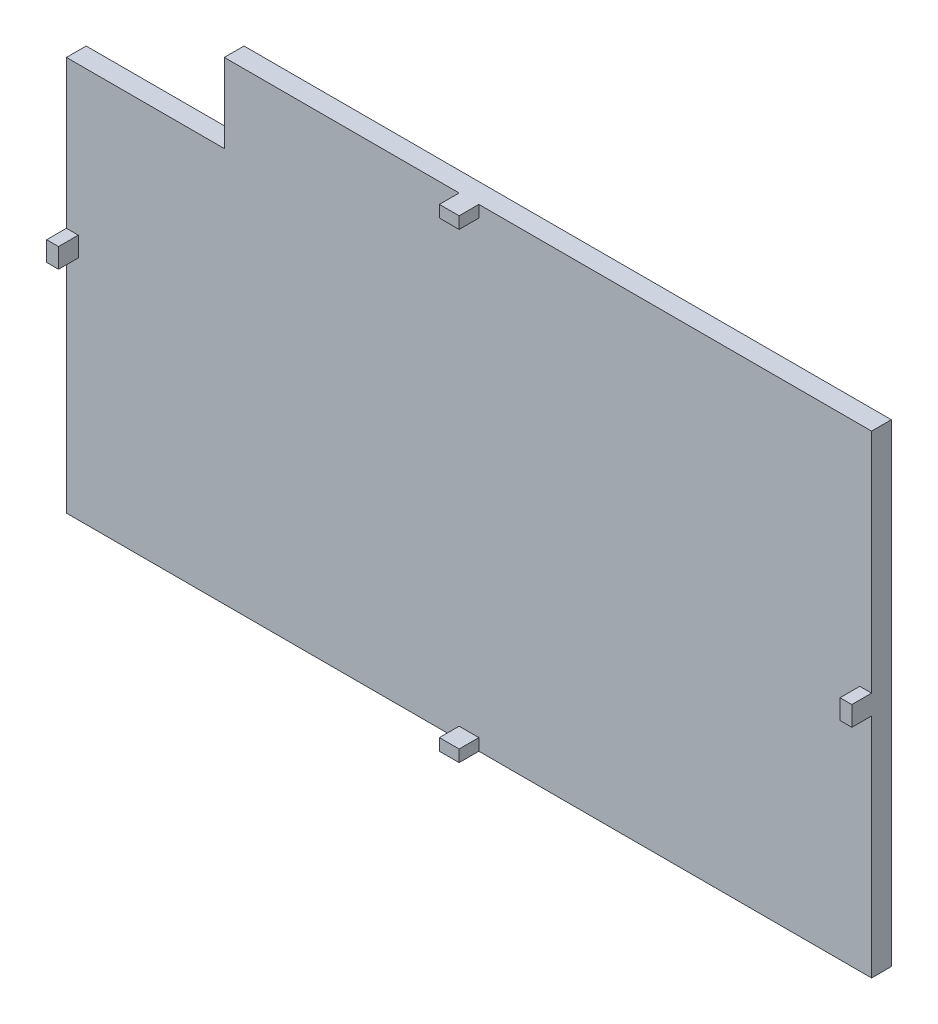
ISO-10303-21;
HEADER;
FILE_DESCRIPTION(('STEP AP214'),'2;1');
FILE_NAME('part.step','',(''),(''),'','','');
FILE_SCHEMA(('AUTOMOTIVE_DESIGN { 1 0 10303 214 1 1 1 1 }'));
ENDSEC;
DATA;
#1=APPLICATION_CONTEXT('core data for automotive mechanical design processes');
#2=APPLICATION_PROTOCOL_DEFINITION('international standard','automotive_design',2000,#1);
#3=PRODUCT_CONTEXT('',#1,'mechanical');
#4=PRODUCT('Part','Part','',(#3));
#5=PRODUCT_RELATED_PRODUCT_CATEGORY('part','',(#4));
#6=PRODUCT_DEFINITION_FORMATION('','',#4);
#7=PRODUCT_DEFINITION_CONTEXT('part definition',#1,'design');
#8=PRODUCT_DEFINITION('design','',#6,#7);
#9=PRODUCT_DEFINITION_SHAPE('','',#8);
#10=(LENGTH_UNIT() NAMED_UNIT(*) SI_UNIT(.MILLI.,.METRE.));
#11=(NAMED_UNIT(*) PLANE_ANGLE_UNIT() SI_UNIT($,.RADIAN.));
#12=(NAMED_UNIT(*) SI_UNIT($,.STERADIAN.) SOLID_ANGLE_UNIT());
#13=UNCERTAINTY_MEASURE_WITH_UNIT(LENGTH_MEASURE(1.E-05),#10,'distance_accuracy_value','');
#14=(GEOMETRIC_REPRESENTATION_CONTEXT(3) GLOBAL_UNCERTAINTY_ASSIGNED_CONTEXT((#13)) GLOBAL_UNIT_ASSIGNED_CONTEXT((#10,
#11,#12)) REPRESENTATION_CONTEXT('',''));
#15=CARTESIAN_POINT('',(0.,0.,0.));
#16=DIRECTION('',(0.,0.,1.));
#17=DIRECTION('',(1.,0.,0.));
#18=AXIS2_PLACEMENT_3D('',#15,#16,#17);
#19=CARTESIAN_POINT('',(0.,0.,5.));
#20=DIRECTION('',(0.,0.,1.));
#21=DIRECTION('',(1.,0.,0.));
#22=AXIS2_PLACEMENT_3D('',#19,#20,#21);
#23=PLANE('',#22);
#24=DIRECTION('',(1.,0.,0.));
#25=VECTOR('',#24,1.);
#26=CARTESIAN_POINT('',(0.,10.8689509306261,5.));
#27=LINE('',#26,#25);
#28=CARTESIAN_POINT('',(-51.4207056882735,10.8689509306261,5.));
#29=VERTEX_POINT('',#28);
#30=CARTESIAN_POINT('',(-11.4207056882735,10.8689509306261,5.));
#31=VERTEX_POINT('',#30);
#32=EDGE_CURVE('E190',#29,#31,#27,.T.);
#33=ORIENTED_EDGE('',*,*,#32,.F.);
#34=DIRECTION('',(0.,-1.,0.));
#35=VECTOR('',#34,1.);
#36=CARTESIAN_POINT('',(-51.4207056882735,30.8689509306261,5.));
#37=LINE('',#36,#35);
#38=CARTESIAN_POINT('',(-51.4207056882735,-26.6310490693739,5.));
#39=VERTEX_POINT('',#38);
#40=EDGE_CURVE('E370',#29,#39,#37,.T.);
#41=ORIENTED_EDGE('',*,*,#40,.T.);
#42=DIRECTION('',(1.,0.,0.));
#43=VECTOR('',#42,1.);
#44=CARTESIAN_POINT('',(-51.4207056882735,-26.6310490693739,5.));
#45=LINE('',#44,#43);
#46=CARTESIAN_POINT('',(-48.4207056882735,-26.6310490693739,5.));
#47=VERTEX_POINT('',#46);
#48=EDGE_CURVE('E286',#39,#47,#45,.T.);
#49=ORIENTED_EDGE('',*,*,#48,.T.);
#50=DIRECTION('',(0.,-1.,0.));
#51=VECTOR('',#50,1.);
#52=CARTESIAN_POINT('',(-48.4207056882735,-26.6310490693739,5.));
#53=LINE('',#52,#51);
#54=CARTESIAN_POINT('',(-48.4207056882735,-31.6310490693739,5.));
#55=VERTEX_POINT('',#54);
#56=EDGE_CURVE('E283',#47,#55,#53,.T.);
#57=ORIENTED_EDGE('',*,*,#56,.T.);
#58=DIRECTION('',(1.,0.,0.));
#59=VECTOR('',#58,1.);
#60=CARTESIAN_POINT('',(-51.4207056882735,-31.6310490693739,5.));
#61=LINE('',#60,#59);
#62=CARTESIAN_POINT('',(-51.4207056882735,-31.6310490693739,5.));
#63=VERTEX_POINT('',#62);
#64=EDGE_CURVE('E280',#63,#55,#61,.T.);
#65=ORIENTED_EDGE('',*,*,#64,.F.);
#66=CARTESIAN_POINT('',(-51.4207056882735,-89.1310490693739,5.));
#67=VERTEX_POINT('',#66);
#68=EDGE_CURVE('E346',#63,#67,#37,.T.);
#69=ORIENTED_EDGE('',*,*,#68,.T.);
#70=DIRECTION('',(1.,0.,0.));
#71=VECTOR('',#70,1.);
#72=CARTESIAN_POINT('',(-51.4207056882735,-89.1310490693739,5.));
#73=LINE('',#72,#71);
#74=CARTESIAN_POINT('',(48.0792943117265,-89.1310490693739,5.));
#75=VERTEX_POINT('',#74);
#76=EDGE_CURVE('E368',#67,#75,#73,.T.);
#77=ORIENTED_EDGE('',*,*,#76,.T.);
#78=DIRECTION('',(0.,1.,0.));
#79=VECTOR('',#78,1.);
#80=CARTESIAN_POINT('',(48.0792943117265,-89.1310490693739,5.));
#81=LINE('',#80,#79);
#82=CARTESIAN_POINT('',(48.0792943117265,-86.1310490693739,5.));
#83=VERTEX_POINT('',#82);
#84=EDGE_CURVE('E249',#75,#83,#81,.T.);
#85=ORIENTED_EDGE('',*,*,#84,.T.);
#86=DIRECTION('',(-1.,0.,0.));
#87=VECTOR('',#86,1.);
#88=CARTESIAN_POINT('',(53.0792943117265,-86.1310490693739,5.));
#89=LINE('',#88,#87);
#90=CARTESIAN_POINT('',(53.0792943117265,-86.1310490693739,5.));
#91=VERTEX_POINT('',#90);
#92=EDGE_CURVE('E251',#91,#83,#89,.T.);
#93=ORIENTED_EDGE('',*,*,#92,.F.);
#94=DIRECTION('',(0.,1.,0.));
#95=VECTOR('',#94,1.);
#96=CARTESIAN_POINT('',(53.0792943117265,-89.1310490693739,5.));
#97=LINE('',#96,#95);
#98=CARTESIAN_POINT('',(53.0792943117265,-89.1310490693739,5.));
#99=VERTEX_POINT('',#98);
#100=EDGE_CURVE('E255',#99,#91,#97,.T.);
#101=ORIENTED_EDGE('',*,*,#100,.F.);
#102=CARTESIAN_POINT('',(152.579294311727,-89.1310490693739,5.));
#103=VERTEX_POINT('',#102);
#104=EDGE_CURVE('E369',#99,#103,#73,.T.);
#105=ORIENTED_EDGE('',*,*,#104,.T.);
#106=DIRECTION('',(0.,-1.,0.));
#107=VECTOR('',#106,1.);
#108=CARTESIAN_POINT('',(152.579294311726,30.8689509306261,5.));
#109=LINE('',#108,#107);
#110=CARTESIAN_POINT('',(152.579294311727,-31.6310490693739,5.));
#111=VERTEX_POINT('',#110);
#112=EDGE_CURVE('E355',#111,#103,#109,.T.);
#113=ORIENTED_EDGE('',*,*,#112,.F.);
#114=DIRECTION('',(-1.,0.,0.));
#115=VECTOR('',#114,1.);
#116=CARTESIAN_POINT('',(152.579294311726,-31.6310490693739,5.));
#117=LINE('',#116,#115);
#118=CARTESIAN_POINT('',(149.579294311726,-31.6310490693739,5.));
#119=VERTEX_POINT('',#118);
#120=EDGE_CURVE('E58',#111,#119,#117,.T.);
#121=ORIENTED_EDGE('',*,*,#120,.T.);
#122=DIRECTION('',(0.,-1.,0.));
#123=VECTOR('',#122,1.);
#124=CARTESIAN_POINT('',(149.579294311726,-26.6310490693739,5.));
#125=LINE('',#124,#123);
#126=CARTESIAN_POINT('',(149.579294311726,-26.6310490693739,5.));
#127=VERTEX_POINT('',#126);
#128=EDGE_CURVE('E220',#127,#119,#125,.T.);
#129=ORIENTED_EDGE('',*,*,#128,.F.);
#130=DIRECTION('',(-1.,0.,0.));
#131=VECTOR('',#130,1.);
#132=CARTESIAN_POINT('',(152.579294311726,-26.6310490693739,5.));
#133=LINE('',#132,#131);
#134=CARTESIAN_POINT('',(152.579294311726,-26.6310490693739,5.));
#135=VERTEX_POINT('',#134);
#136=EDGE_CURVE('E224',#135,#127,#133,.T.);
#137=ORIENTED_EDGE('',*,*,#136,.F.);
#138=CARTESIAN_POINT('',(152.579294311726,30.8689509306261,5.));
#139=VERTEX_POINT('',#138);
#140=EDGE_CURVE('E330',#139,#135,#109,.T.);
#141=ORIENTED_EDGE('',*,*,#140,.F.);
#142=DIRECTION('',(1.,0.,0.));
#143=VECTOR('',#142,1.);
#144=CARTESIAN_POINT('',(-51.4207056882735,30.8689509306261,5.));
#145=LINE('',#144,#143);
#146=CARTESIAN_POINT('',(53.0792943117265,30.8689509306261,5.));
#147=VERTEX_POINT('',#146);
#148=EDGE_CURVE('E329',#147,#139,#145,.T.);
#149=ORIENTED_EDGE('',*,*,#148,.F.);
#150=DIRECTION('',(0.,-1.,0.));
#151=VECTOR('',#150,1.);
#152=CARTESIAN_POINT('',(53.0792943117265,30.8689509306261,5.));
#153=LINE('',#152,#151);
#154=CARTESIAN_POINT('',(53.0792943117265,27.8689509306261,5.));
#155=VERTEX_POINT('',#154);
#156=EDGE_CURVE('E288',#147,#155,#153,.T.);
#157=ORIENTED_EDGE('',*,*,#156,.T.);
#158=DIRECTION('',(-1.,0.,0.));
#159=VECTOR('',#158,1.);
#160=CARTESIAN_POINT('',(53.0792943117265,27.8689509306261,5.));
#161=LINE('',#160,#159);
#162=CARTESIAN_POINT('',(48.0792943117265,27.8689509306261,5.));
#163=VERTEX_POINT('',#162);
#164=EDGE_CURVE('E311',#155,#163,#161,.T.);
#165=ORIENTED_EDGE('',*,*,#164,.T.);
#166=DIRECTION('',(0.,-1.,0.));
#167=VECTOR('',#166,1.);
#168=CARTESIAN_POINT('',(48.0792943117265,30.8689509306261,5.));
#169=LINE('',#168,#167);
#170=CARTESIAN_POINT('',(48.0792943117265,30.8689509306261,5.));
#171=VERTEX_POINT('',#170);
#172=EDGE_CURVE('E301',#171,#163,#169,.T.);
#173=ORIENTED_EDGE('',*,*,#172,.F.);
#174=CARTESIAN_POINT('',(-11.4207056882735,30.8689509306261,5.));
#175=VERTEX_POINT('',#174);
#176=EDGE_CURVE('E36',#175,#171,#145,.T.);
#177=ORIENTED_EDGE('',*,*,#176,.F.);
#178=DIRECTION('',(0.,1.,0.));
#179=VECTOR('',#178,1.);
#180=CARTESIAN_POINT('',(-11.4207056882735,0.,5.));
#181=LINE('',#180,#179);
#182=EDGE_CURVE('E206',#31,#175,#181,.T.);
#183=ORIENTED_EDGE('',*,*,#182,.F.);
#184=EDGE_LOOP('',(#33,#41,#49,#57,#65,#69,#77,#85,#93,#101,#105,#113,#121,#129,#137,#141,#149,
#157,#165,#173,#177,#183));
#185=FACE_BOUND('',#184,.T.);
#186=ADVANCED_FACE('F32',(#185),#23,.T.);
#187=CARTESIAN_POINT('',(-51.4207056882735,30.8689509306261,5.));
#188=DIRECTION('',(1.,0.,0.));
#189=DIRECTION('',(0.,1.,0.));
#190=AXIS2_PLACEMENT_3D('',#187,#188,#189);
#191=PLANE('',#190);
#192=ORIENTED_EDGE('',*,*,#40,.F.);
#193=DIRECTION('',(0.,0.,-1.));
#194=VECTOR('',#193,1.);
#195=CARTESIAN_POINT('',(-51.4207056882735,10.8689509306261,10.));
#196=LINE('',#195,#194);
#197=CARTESIAN_POINT('',(-51.4207056882735,10.8689509306261,0.));
#198=VERTEX_POINT('',#197);
#199=EDGE_CURVE('E192',#29,#198,#196,.T.);
#200=ORIENTED_EDGE('',*,*,#199,.T.);
#201=DIRECTION('',(0.,-1.,0.));
#202=VECTOR('',#201,1.);
#203=CARTESIAN_POINT('',(-51.4207056882735,30.8689509306261,0.));
#204=LINE('',#203,#202);
#205=CARTESIAN_POINT('',(-51.4207056882735,-89.1310490693739,0.));
#206=VERTEX_POINT('',#205);
#207=EDGE_CURVE('E202',#198,#206,#204,.T.);
#208=ORIENTED_EDGE('',*,*,#207,.T.);
#209=DIRECTION('',(0.,0.,-1.));
#210=VECTOR('',#209,1.);
#211=CARTESIAN_POINT('',(-51.4207056882735,-89.1310490693739,5.));
#212=LINE('',#211,#210);
#213=EDGE_CURVE('E11',#67,#206,#212,.T.);
#214=ORIENTED_EDGE('',*,*,#213,.F.);
#215=ORIENTED_EDGE('',*,*,#68,.F.);
#216=DIRECTION('',(0.,0.,-1.));
#217=VECTOR('',#216,1.);
#218=CARTESIAN_POINT('',(-51.4207056882735,-31.6310490693739,10.));
#219=LINE('',#218,#217);
#220=CARTESIAN_POINT('',(-51.4207056882735,-31.6310490693739,10.));
#221=VERTEX_POINT('',#220);
#222=EDGE_CURVE('E275',#221,#63,#219,.T.);
#223=ORIENTED_EDGE('',*,*,#222,.F.);
#224=DIRECTION('',(0.,-1.,0.));
#225=VECTOR('',#224,1.);
#226=CARTESIAN_POINT('',(-51.4207056882735,-26.6310490693739,10.));
#227=LINE('',#226,#225);
#228=CARTESIAN_POINT('',(-51.4207056882735,-26.6310490693739,10.));
#229=VERTEX_POINT('',#228);
#230=EDGE_CURVE('E271',#229,#221,#227,.T.);
#231=ORIENTED_EDGE('',*,*,#230,.F.);
#232=DIRECTION('',(0.,0.,-1.));
#233=VECTOR('',#232,1.);
#234=CARTESIAN_POINT('',(-51.4207056882735,-26.6310490693739,10.));
#235=LINE('',#234,#233);
#236=EDGE_CURVE('E258',#229,#39,#235,.T.);
#237=ORIENTED_EDGE('',*,*,#236,.T.);
#238=EDGE_LOOP('',(#192,#200,#208,#214,#215,#223,#231,#237));
#239=FACE_BOUND('',#238,.T.);
#240=ADVANCED_FACE('F34',(#239),#191,.F.);
#241=CARTESIAN_POINT('',(-51.4207056882735,-89.1310490693739,5.));
#242=DIRECTION('',(0.,1.,0.));
#243=DIRECTION('',(0.,0.,1.));
#244=AXIS2_PLACEMENT_3D('',#241,#242,#243);
#245=PLANE('',#244);
#246=DIRECTION('',(1.,0.,0.));
#247=VECTOR('',#246,1.);
#248=CARTESIAN_POINT('',(-51.4207056882735,-89.1310490693739,0.));
#249=LINE('',#248,#247);
#250=CARTESIAN_POINT('',(152.579294311727,-89.1310490693739,0.));
#251=VERTEX_POINT('',#250);
#252=EDGE_CURVE('E338',#206,#251,#249,.T.);
#253=ORIENTED_EDGE('',*,*,#252,.T.);
#254=DIRECTION('',(0.,0.,-1.));
#255=VECTOR('',#254,1.);
#256=CARTESIAN_POINT('',(152.579294311727,-89.1310490693739,5.));
#257=LINE('',#256,#255);
#258=EDGE_CURVE('E42',#103,#251,#257,.T.);
#259=ORIENTED_EDGE('',*,*,#258,.F.);
#260=ORIENTED_EDGE('',*,*,#104,.F.);
#261=DIRECTION('',(0.,0.,-1.));
#262=VECTOR('',#261,1.);
#263=CARTESIAN_POINT('',(53.0792943117265,-89.1310490693739,10.));
#264=LINE('',#263,#262);
#265=CARTESIAN_POINT('',(53.0792943117265,-89.1310490693739,10.));
#266=VERTEX_POINT('',#265);
#267=EDGE_CURVE('E245',#266,#99,#264,.T.);
#268=ORIENTED_EDGE('',*,*,#267,.F.);
#269=DIRECTION('',(-1.,0.,0.));
#270=VECTOR('',#269,1.);
#271=CARTESIAN_POINT('',(53.0792943117265,-89.1310490693739,10.));
#272=LINE('',#271,#270);
#273=CARTESIAN_POINT('',(48.0792943117265,-89.1310490693739,10.));
#274=VERTEX_POINT('',#273);
#275=EDGE_CURVE('E248',#266,#274,#272,.T.);
#276=ORIENTED_EDGE('',*,*,#275,.T.);
#277=DIRECTION('',(0.,0.,-1.));
#278=VECTOR('',#277,1.);
#279=CARTESIAN_POINT('',(48.0792943117265,-89.1310490693739,10.));
#280=LINE('',#279,#278);
#281=EDGE_CURVE('E242',#274,#75,#280,.T.);
#282=ORIENTED_EDGE('',*,*,#281,.T.);
#283=ORIENTED_EDGE('',*,*,#76,.F.);
#284=ORIENTED_EDGE('',*,*,#213,.T.);
#285=EDGE_LOOP('',(#253,#259,#260,#268,#276,#282,#283,#284));
#286=FACE_BOUND('',#285,.T.);
#287=ADVANCED_FACE('F358',(#286),#245,.F.);
#288=CARTESIAN_POINT('',(152.579294311726,30.8689509306261,5.));
#289=DIRECTION('',(1.,0.,0.));
#290=DIRECTION('',(0.,1.,0.));
#291=AXIS2_PLACEMENT_3D('',#288,#289,#290);
#292=PLANE('',#291);
#293=DIRECTION('',(0.,-1.,0.));
#294=VECTOR('',#293,1.);
#295=CARTESIAN_POINT('',(152.579294311726,30.8689509306261,0.));
#296=LINE('',#295,#294);
#297=CARTESIAN_POINT('',(152.579294311726,30.8689509306261,0.));
#298=VERTEX_POINT('',#297);
#299=EDGE_CURVE('E341',#298,#251,#296,.T.);
#300=ORIENTED_EDGE('',*,*,#299,.F.);
#301=DIRECTION('',(0.,0.,-1.));
#302=VECTOR('',#301,1.);
#303=CARTESIAN_POINT('',(152.579294311726,30.8689509306261,5.));
#304=LINE('',#303,#302);
#305=EDGE_CURVE('E347',#139,#298,#304,.T.);
#306=ORIENTED_EDGE('',*,*,#305,.F.);
#307=ORIENTED_EDGE('',*,*,#140,.T.);
#308=DIRECTION('',(0.,0.,-1.));
#309=VECTOR('',#308,1.);
#310=CARTESIAN_POINT('',(152.579294311726,-26.6310490693739,10.));
#311=LINE('',#310,#309);
#312=CARTESIAN_POINT('',(152.579294311726,-26.6310490693739,10.));
#313=VERTEX_POINT('',#312);
#314=EDGE_CURVE('E216',#313,#135,#311,.T.);
#315=ORIENTED_EDGE('',*,*,#314,.F.);
#316=DIRECTION('',(0.,-1.,0.));
#317=VECTOR('',#316,1.);
#318=CARTESIAN_POINT('',(152.579294311726,-26.6310490693739,10.));
#319=LINE('',#318,#317);
#320=CARTESIAN_POINT('',(152.579294311726,-31.6310490693739,10.));
#321=VERTEX_POINT('',#320);
#322=EDGE_CURVE('E218',#313,#321,#319,.T.);
#323=ORIENTED_EDGE('',*,*,#322,.T.);
#324=DIRECTION('',(0.,0.,-1.));
#325=VECTOR('',#324,1.);
#326=CARTESIAN_POINT('',(152.579294311726,-31.6310490693739,10.));
#327=LINE('',#326,#325);
#328=EDGE_CURVE('E214',#321,#111,#327,.T.);
#329=ORIENTED_EDGE('',*,*,#328,.T.);
#330=ORIENTED_EDGE('',*,*,#112,.T.);
#331=ORIENTED_EDGE('',*,*,#258,.T.);
#332=EDGE_LOOP('',(#300,#306,#307,#315,#323,#329,#330,#331));
#333=FACE_BOUND('',#332,.T.);
#334=ADVANCED_FACE('F352',(#333),#292,.T.);
#335=CARTESIAN_POINT('',(-51.4207056882735,30.8689509306261,5.));
#336=DIRECTION('',(0.,1.,0.));
#337=DIRECTION('',(0.,0.,1.));
#338=AXIS2_PLACEMENT_3D('',#335,#336,#337);
#339=PLANE('',#338);
#340=DIRECTION('',(0.,0.,-1.));
#341=VECTOR('',#340,1.);
#342=CARTESIAN_POINT('',(-11.4207056882735,30.8689509306261,10.));
#343=LINE('',#342,#341);
#344=CARTESIAN_POINT('',(-11.4207056882735,30.8689509306261,0.));
#345=VERTEX_POINT('',#344);
#346=EDGE_CURVE('E50',#175,#345,#343,.T.);
#347=ORIENTED_EDGE('',*,*,#346,.F.);
#348=ORIENTED_EDGE('',*,*,#176,.T.);
#349=DIRECTION('',(0.,0.,-1.));
#350=VECTOR('',#349,1.);
#351=CARTESIAN_POINT('',(48.0792943117265,30.8689509306261,10.));
#352=LINE('',#351,#350);
#353=CARTESIAN_POINT('',(48.0792943117265,30.8689509306261,10.));
#354=VERTEX_POINT('',#353);
#355=EDGE_CURVE('E319',#354,#171,#352,.T.);
#356=ORIENTED_EDGE('',*,*,#355,.F.);
#357=DIRECTION('',(-1.,0.,0.));
#358=VECTOR('',#357,1.);
#359=CARTESIAN_POINT('',(53.0792943117265,30.8689509306261,10.));
#360=LINE('',#359,#358);
#361=CARTESIAN_POINT('',(53.0792943117265,30.8689509306261,10.));
#362=VERTEX_POINT('',#361);
#363=EDGE_CURVE('E306',#362,#354,#360,.T.);
#364=ORIENTED_EDGE('',*,*,#363,.F.);
#365=DIRECTION('',(0.,0.,-1.));
#366=VECTOR('',#365,1.);
#367=CARTESIAN_POINT('',(53.0792943117265,30.8689509306261,10.));
#368=LINE('',#367,#366);
#369=EDGE_CURVE('E316',#362,#147,#368,.T.);
#370=ORIENTED_EDGE('',*,*,#369,.T.);
#371=ORIENTED_EDGE('',*,*,#148,.T.);
#372=ORIENTED_EDGE('',*,*,#305,.T.);
#373=DIRECTION('',(1.,0.,0.));
#374=VECTOR('',#373,1.);
#375=CARTESIAN_POINT('',(-51.4207056882735,30.8689509306261,0.));
#376=LINE('',#375,#374);
#377=EDGE_CURVE('E344',#345,#298,#376,.T.);
#378=ORIENTED_EDGE('',*,*,#377,.F.);
#379=EDGE_LOOP('',(#347,#348,#356,#364,#370,#371,#372,#378));
#380=FACE_BOUND('',#379,.T.);
#381=ADVANCED_FACE('F362',(#380),#339,.T.);
#382=CARTESIAN_POINT('',(0.,0.,0.));
#383=DIRECTION('',(0.,0.,1.));
#384=DIRECTION('',(1.,0.,0.));
#385=AXIS2_PLACEMENT_3D('',#382,#383,#384);
#386=PLANE('',#385);
#387=ORIENTED_EDGE('',*,*,#207,.F.);
#388=DIRECTION('',(-1.,0.,0.));
#389=VECTOR('',#388,1.);
#390=CARTESIAN_POINT('',(-51.4207056882735,10.8689509306261,0.));
#391=LINE('',#390,#389);
#392=CARTESIAN_POINT('',(-11.4207056882735,10.8689509306261,0.));
#393=VERTEX_POINT('',#392);
#394=EDGE_CURVE('E187',#393,#198,#391,.T.);
#395=ORIENTED_EDGE('',*,*,#394,.F.);
#396=DIRECTION('',(0.,-1.,0.));
#397=VECTOR('',#396,1.);
#398=CARTESIAN_POINT('',(-11.4207056882735,30.8689509306261,0.));
#399=LINE('',#398,#397);
#400=EDGE_CURVE('E194',#345,#393,#399,.T.);
#401=ORIENTED_EDGE('',*,*,#400,.F.);
#402=ORIENTED_EDGE('',*,*,#377,.T.);
#403=ORIENTED_EDGE('',*,*,#299,.T.);
#404=ORIENTED_EDGE('',*,*,#252,.F.);
#405=EDGE_LOOP('',(#387,#395,#401,#402,#403,#404));
#406=FACE_BOUND('',#405,.T.);
#407=ADVANCED_FACE('F200',(#406),#386,.F.);
#408=CARTESIAN_POINT('',(53.0792943117265,30.8689509306261,10.));
#409=DIRECTION('',(1.,0.,0.));
#410=DIRECTION('',(0.,1.,0.));
#411=AXIS2_PLACEMENT_3D('',#408,#409,#410);
#412=PLANE('',#411);
#413=ORIENTED_EDGE('',*,*,#156,.F.);
#414=ORIENTED_EDGE('',*,*,#369,.F.);
#415=DIRECTION('',(0.,-1.,0.));
#416=VECTOR('',#415,1.);
#417=CARTESIAN_POINT('',(53.0792943117265,30.8689509306261,10.));
#418=LINE('',#417,#416);
#419=CARTESIAN_POINT('',(53.0792943117265,27.8689509306261,10.));
#420=VERTEX_POINT('',#419);
#421=EDGE_CURVE('E297',#362,#420,#418,.T.);
#422=ORIENTED_EDGE('',*,*,#421,.T.);
#423=DIRECTION('',(0.,0.,-1.));
#424=VECTOR('',#423,1.);
#425=CARTESIAN_POINT('',(53.0792943117265,27.8689509306261,10.));
#426=LINE('',#425,#424);
#427=EDGE_CURVE('E308',#420,#155,#426,.T.);
#428=ORIENTED_EDGE('',*,*,#427,.T.);
#429=EDGE_LOOP('',(#413,#414,#422,#428));
#430=FACE_BOUND('',#429,.T.);
#431=ADVANCED_FACE('F388',(#430),#412,.T.);
#432=CARTESIAN_POINT('',(48.0792943117265,30.8689509306261,10.));
#433=DIRECTION('',(1.,0.,0.));
#434=DIRECTION('',(0.,0.,-1.));
#435=AXIS2_PLACEMENT_3D('',#432,#433,#434);
#436=PLANE('',#435);
#437=ORIENTED_EDGE('',*,*,#172,.T.);
#438=DIRECTION('',(0.,0.,-1.));
#439=VECTOR('',#438,1.);
#440=CARTESIAN_POINT('',(48.0792943117265,27.8689509306261,10.));
#441=LINE('',#440,#439);
#442=CARTESIAN_POINT('',(48.0792943117265,27.8689509306261,10.));
#443=VERTEX_POINT('',#442);
#444=EDGE_CURVE('E324',#443,#163,#441,.T.);
#445=ORIENTED_EDGE('',*,*,#444,.F.);
#446=DIRECTION('',(0.,-1.,0.));
#447=VECTOR('',#446,1.);
#448=CARTESIAN_POINT('',(48.0792943117265,30.8689509306261,10.));
#449=LINE('',#448,#447);
#450=EDGE_CURVE('E304',#354,#443,#449,.T.);
#451=ORIENTED_EDGE('',*,*,#450,.F.);
#452=ORIENTED_EDGE('',*,*,#355,.T.);
#453=EDGE_LOOP('',(#437,#445,#451,#452));
#454=FACE_BOUND('',#453,.T.);
#455=ADVANCED_FACE('F383',(#454),#436,.F.);
#456=CARTESIAN_POINT('',(53.0792943117265,27.8689509306261,10.));
#457=DIRECTION('',(0.,-1.,0.));
#458=DIRECTION('',(1.,0.,0.));
#459=AXIS2_PLACEMENT_3D('',#456,#457,#458);
#460=PLANE('',#459);
#461=ORIENTED_EDGE('',*,*,#164,.F.);
#462=ORIENTED_EDGE('',*,*,#427,.F.);
#463=DIRECTION('',(-1.,0.,0.));
#464=VECTOR('',#463,1.);
#465=CARTESIAN_POINT('',(53.0792943117265,27.8689509306261,10.));
#466=LINE('',#465,#464);
#467=EDGE_CURVE('E300',#420,#443,#466,.T.);
#468=ORIENTED_EDGE('',*,*,#467,.T.);
#469=ORIENTED_EDGE('',*,*,#444,.T.);
#470=EDGE_LOOP('',(#461,#462,#468,#469));
#471=FACE_BOUND('',#470,.T.);
#472=ADVANCED_FACE('F378',(#471),#460,.T.);
#473=CARTESIAN_POINT('',(0.,0.,10.));
#474=DIRECTION('',(0.,0.,-1.));
#475=DIRECTION('',(-1.,0.,0.));
#476=AXIS2_PLACEMENT_3D('',#473,#474,#475);
#477=PLANE('',#476);
#478=ORIENTED_EDGE('',*,*,#421,.F.);
#479=ORIENTED_EDGE('',*,*,#363,.T.);
#480=ORIENTED_EDGE('',*,*,#450,.T.);
#481=ORIENTED_EDGE('',*,*,#467,.F.);
#482=EDGE_LOOP('',(#478,#479,#480,#481));
#483=FACE_BOUND('',#482,.T.);
#484=ADVANCED_FACE('F391',(#483),#477,.F.);
#485=CARTESIAN_POINT('',(-51.4207056882735,-26.6310490693739,10.));
#486=DIRECTION('',(0.,1.,0.));
#487=DIRECTION('',(0.,0.,1.));
#488=AXIS2_PLACEMENT_3D('',#485,#486,#487);
#489=PLANE('',#488);
#490=ORIENTED_EDGE('',*,*,#48,.F.);
#491=ORIENTED_EDGE('',*,*,#236,.F.);
#492=DIRECTION('',(1.,0.,0.));
#493=VECTOR('',#492,1.);
#494=CARTESIAN_POINT('',(-51.4207056882735,-26.6310490693739,10.));
#495=LINE('',#494,#493);
#496=CARTESIAN_POINT('',(-48.4207056882735,-26.6310490693739,10.));
#497=VERTEX_POINT('',#496);
#498=EDGE_CURVE('E284',#229,#497,#495,.T.);
#499=ORIENTED_EDGE('',*,*,#498,.T.);
#500=DIRECTION('',(0.,0.,-1.));
#501=VECTOR('',#500,1.);
#502=CARTESIAN_POINT('',(-48.4207056882735,-26.6310490693739,10.));
#503=LINE('',#502,#501);
#504=EDGE_CURVE('E268',#497,#47,#503,.T.);
#505=ORIENTED_EDGE('',*,*,#504,.T.);
#506=EDGE_LOOP('',(#490,#491,#499,#505));
#507=FACE_BOUND('',#506,.T.);
#508=ADVANCED_FACE('F394',(#507),#489,.T.);
#509=CARTESIAN_POINT('',(-51.4207056882735,-31.6310490693739,10.));
#510=DIRECTION('',(0.,1.,0.));
#511=DIRECTION('',(0.,0.,1.));
#512=AXIS2_PLACEMENT_3D('',#509,#510,#511);
#513=PLANE('',#512);
#514=ORIENTED_EDGE('',*,*,#64,.T.);
#515=DIRECTION('',(0.,0.,-1.));
#516=VECTOR('',#515,1.);
#517=CARTESIAN_POINT('',(-48.4207056882735,-31.6310490693739,10.));
#518=LINE('',#517,#516);
#519=CARTESIAN_POINT('',(-48.4207056882735,-31.6310490693739,10.));
#520=VERTEX_POINT('',#519);
#521=EDGE_CURVE('E272',#520,#55,#518,.T.);
#522=ORIENTED_EDGE('',*,*,#521,.F.);
#523=DIRECTION('',(1.,0.,0.));
#524=VECTOR('',#523,1.);
#525=CARTESIAN_POINT('',(-51.4207056882735,-31.6310490693739,10.));
#526=LINE('',#525,#524);
#527=EDGE_CURVE('E290',#221,#520,#526,.T.);
#528=ORIENTED_EDGE('',*,*,#527,.F.);
#529=ORIENTED_EDGE('',*,*,#222,.T.);
#530=EDGE_LOOP('',(#514,#522,#528,#529));
#531=FACE_BOUND('',#530,.T.);
#532=ADVANCED_FACE('F400',(#531),#513,.F.);
#533=CARTESIAN_POINT('',(-48.4207056882735,-26.6310490693739,10.));
#534=DIRECTION('',(1.,0.,0.));
#535=DIRECTION('',(0.,0.,-1.));
#536=AXIS2_PLACEMENT_3D('',#533,#534,#535);
#537=PLANE('',#536);
#538=ORIENTED_EDGE('',*,*,#56,.F.);
#539=ORIENTED_EDGE('',*,*,#504,.F.);
#540=DIRECTION('',(0.,-1.,0.));
#541=VECTOR('',#540,1.);
#542=CARTESIAN_POINT('',(-48.4207056882735,-26.6310490693739,10.));
#543=LINE('',#542,#541);
#544=EDGE_CURVE('E292',#497,#520,#543,.T.);
#545=ORIENTED_EDGE('',*,*,#544,.T.);
#546=ORIENTED_EDGE('',*,*,#521,.T.);
#547=EDGE_LOOP('',(#538,#539,#545,#546));
#548=FACE_BOUND('',#547,.T.);
#549=ADVANCED_FACE('F478',(#548),#537,.T.);
#550=CARTESIAN_POINT('',(0.,0.,10.));
#551=DIRECTION('',(0.,0.,-1.));
#552=DIRECTION('',(-1.,0.,0.));
#553=AXIS2_PLACEMENT_3D('',#550,#551,#552);
#554=PLANE('',#553);
#555=ORIENTED_EDGE('',*,*,#498,.F.);
#556=ORIENTED_EDGE('',*,*,#230,.T.);
#557=ORIENTED_EDGE('',*,*,#527,.T.);
#558=ORIENTED_EDGE('',*,*,#544,.F.);
#559=EDGE_LOOP('',(#555,#556,#557,#558));
#560=FACE_BOUND('',#559,.T.);
#561=ADVANCED_FACE('F488',(#560),#554,.F.);
#562=CARTESIAN_POINT('',(53.0792943117265,-89.1310490693739,10.));
#563=DIRECTION('',(-1.,0.,0.));
#564=DIRECTION('',(0.,0.,1.));
#565=AXIS2_PLACEMENT_3D('',#562,#563,#564);
#566=PLANE('',#565);
#567=ORIENTED_EDGE('',*,*,#100,.T.);
#568=DIRECTION('',(0.,0.,-1.));
#569=VECTOR('',#568,1.);
#570=CARTESIAN_POINT('',(53.0792943117265,-86.1310490693739,10.));
#571=LINE('',#570,#569);
#572=CARTESIAN_POINT('',(53.0792943117265,-86.1310490693739,10.));
#573=VERTEX_POINT('',#572);
#574=EDGE_CURVE('E227',#573,#91,#571,.T.);
#575=ORIENTED_EDGE('',*,*,#574,.F.);
#576=DIRECTION('',(0.,1.,0.));
#577=VECTOR('',#576,1.);
#578=CARTESIAN_POINT('',(53.0792943117265,-89.1310490693739,10.));
#579=LINE('',#578,#577);
#580=EDGE_CURVE('E252',#266,#573,#579,.T.);
#581=ORIENTED_EDGE('',*,*,#580,.F.);
#582=ORIENTED_EDGE('',*,*,#267,.T.);
#583=EDGE_LOOP('',(#567,#575,#581,#582));
#584=FACE_BOUND('',#583,.T.);
#585=ADVANCED_FACE('F498',(#584),#566,.F.);
#586=CARTESIAN_POINT('',(53.0792943117265,-86.1310490693739,10.));
#587=DIRECTION('',(0.,-1.,0.));
#588=DIRECTION('',(0.,0.,-1.));
#589=AXIS2_PLACEMENT_3D('',#586,#587,#588);
#590=PLANE('',#589);
#591=ORIENTED_EDGE('',*,*,#92,.T.);
#592=DIRECTION('',(0.,0.,-1.));
#593=VECTOR('',#592,1.);
#594=CARTESIAN_POINT('',(48.0792943117265,-86.1310490693739,10.));
#595=LINE('',#594,#593);
#596=CARTESIAN_POINT('',(48.0792943117265,-86.1310490693739,10.));
#597=VERTEX_POINT('',#596);
#598=EDGE_CURVE('E239',#597,#83,#595,.T.);
#599=ORIENTED_EDGE('',*,*,#598,.F.);
#600=DIRECTION('',(-1.,0.,0.));
#601=VECTOR('',#600,1.);
#602=CARTESIAN_POINT('',(53.0792943117265,-86.1310490693739,10.));
#603=LINE('',#602,#601);
#604=EDGE_CURVE('E264',#573,#597,#603,.T.);
#605=ORIENTED_EDGE('',*,*,#604,.F.);
#606=ORIENTED_EDGE('',*,*,#574,.T.);
#607=EDGE_LOOP('',(#591,#599,#605,#606));
#608=FACE_BOUND('',#607,.T.);
#609=ADVANCED_FACE('F507',(#608),#590,.F.);
#610=CARTESIAN_POINT('',(48.0792943117265,-89.1310490693739,10.));
#611=DIRECTION('',(-1.,0.,0.));
#612=DIRECTION('',(0.,0.,1.));
#613=AXIS2_PLACEMENT_3D('',#610,#611,#612);
#614=PLANE('',#613);
#615=ORIENTED_EDGE('',*,*,#84,.F.);
#616=ORIENTED_EDGE('',*,*,#281,.F.);
#617=DIRECTION('',(0.,1.,0.));
#618=VECTOR('',#617,1.);
#619=CARTESIAN_POINT('',(48.0792943117265,-89.1310490693739,10.));
#620=LINE('',#619,#618);
#621=EDGE_CURVE('E261',#274,#597,#620,.T.);
#622=ORIENTED_EDGE('',*,*,#621,.T.);
#623=ORIENTED_EDGE('',*,*,#598,.T.);
#624=EDGE_LOOP('',(#615,#616,#622,#623));
#625=FACE_BOUND('',#624,.T.);
#626=ADVANCED_FACE('F517',(#625),#614,.T.);
#627=CARTESIAN_POINT('',(0.,0.,10.));
#628=DIRECTION('',(0.,0.,1.));
#629=DIRECTION('',(1.,0.,0.));
#630=AXIS2_PLACEMENT_3D('',#627,#628,#629);
#631=PLANE('',#630);
#632=ORIENTED_EDGE('',*,*,#580,.T.);
#633=ORIENTED_EDGE('',*,*,#604,.T.);
#634=ORIENTED_EDGE('',*,*,#621,.F.);
#635=ORIENTED_EDGE('',*,*,#275,.F.);
#636=EDGE_LOOP('',(#632,#633,#634,#635));
#637=FACE_BOUND('',#636,.T.);
#638=ADVANCED_FACE('F527',(#637),#631,.T.);
#639=CARTESIAN_POINT('',(152.579294311726,-26.6310490693739,10.));
#640=DIRECTION('',(0.,-1.,0.));
#641=DIRECTION('',(1.,0.,0.));
#642=AXIS2_PLACEMENT_3D('',#639,#640,#641);
#643=PLANE('',#642);
#644=ORIENTED_EDGE('',*,*,#136,.T.);
#645=DIRECTION('',(0.,0.,-1.));
#646=VECTOR('',#645,1.);
#647=CARTESIAN_POINT('',(149.579294311726,-26.6310490693739,10.));
#648=LINE('',#647,#646);
#649=CARTESIAN_POINT('',(149.579294311726,-26.6310490693739,10.));
#650=VERTEX_POINT('',#649);
#651=EDGE_CURVE('E210',#650,#127,#648,.T.);
#652=ORIENTED_EDGE('',*,*,#651,.F.);
#653=DIRECTION('',(-1.,0.,0.));
#654=VECTOR('',#653,1.);
#655=CARTESIAN_POINT('',(152.579294311726,-26.6310490693739,10.));
#656=LINE('',#655,#654);
#657=EDGE_CURVE('E221',#313,#650,#656,.T.);
#658=ORIENTED_EDGE('',*,*,#657,.F.);
#659=ORIENTED_EDGE('',*,*,#314,.T.);
#660=EDGE_LOOP('',(#644,#652,#658,#659));
#661=FACE_BOUND('',#660,.T.);
#662=ADVANCED_FACE('F537',(#661),#643,.F.);
#663=CARTESIAN_POINT('',(149.579294311726,-26.6310490693739,10.));
#664=DIRECTION('',(1.,0.,0.));
#665=DIRECTION('',(0.,0.,-1.));
#666=AXIS2_PLACEMENT_3D('',#663,#664,#665);
#667=PLANE('',#666);
#668=ORIENTED_EDGE('',*,*,#128,.T.);
#669=DIRECTION('',(0.,0.,-1.));
#670=VECTOR('',#669,1.);
#671=CARTESIAN_POINT('',(149.579294311726,-31.6310490693739,10.));
#672=LINE('',#671,#670);
#673=CARTESIAN_POINT('',(149.579294311726,-31.6310490693739,10.));
#674=VERTEX_POINT('',#673);
#675=EDGE_CURVE('E212',#674,#119,#672,.T.);
#676=ORIENTED_EDGE('',*,*,#675,.F.);
#677=DIRECTION('',(0.,-1.,0.));
#678=VECTOR('',#677,1.);
#679=CARTESIAN_POINT('',(149.579294311726,-26.6310490693739,10.));
#680=LINE('',#679,#678);
#681=EDGE_CURVE('E233',#650,#674,#680,.T.);
#682=ORIENTED_EDGE('',*,*,#681,.F.);
#683=ORIENTED_EDGE('',*,*,#651,.T.);
#684=EDGE_LOOP('',(#668,#676,#682,#683));
#685=FACE_BOUND('',#684,.T.);
#686=ADVANCED_FACE('F547',(#685),#667,.F.);
#687=CARTESIAN_POINT('',(152.579294311726,-31.6310490693739,10.));
#688=DIRECTION('',(0.,-1.,0.));
#689=DIRECTION('',(0.,0.,-1.));
#690=AXIS2_PLACEMENT_3D('',#687,#688,#689);
#691=PLANE('',#690);
#692=ORIENTED_EDGE('',*,*,#120,.F.);
#693=ORIENTED_EDGE('',*,*,#328,.F.);
#694=DIRECTION('',(-1.,0.,0.));
#695=VECTOR('',#694,1.);
#696=CARTESIAN_POINT('',(152.579294311726,-31.6310490693739,10.));
#697=LINE('',#696,#695);
#698=EDGE_CURVE('E230',#321,#674,#697,.T.);
#699=ORIENTED_EDGE('',*,*,#698,.T.);
#700=ORIENTED_EDGE('',*,*,#675,.T.);
#701=EDGE_LOOP('',(#692,#693,#699,#700));
#702=FACE_BOUND('',#701,.T.);
#703=ADVANCED_FACE('F557',(#702),#691,.T.);
#704=CARTESIAN_POINT('',(0.,0.,10.));
#705=DIRECTION('',(0.,0.,1.));
#706=DIRECTION('',(1.,0.,0.));
#707=AXIS2_PLACEMENT_3D('',#704,#705,#706);
#708=PLANE('',#707);
#709=ORIENTED_EDGE('',*,*,#657,.T.);
#710=ORIENTED_EDGE('',*,*,#681,.T.);
#711=ORIENTED_EDGE('',*,*,#698,.F.);
#712=ORIENTED_EDGE('',*,*,#322,.F.);
#713=EDGE_LOOP('',(#709,#710,#711,#712));
#714=FACE_BOUND('',#713,.T.);
#715=ADVANCED_FACE('F566',(#714),#708,.T.);
#716=CARTESIAN_POINT('',(-51.4207056882735,10.8689509306261,10.));
#717=DIRECTION('',(0.,-1.,0.));
#718=DIRECTION('',(1.,0.,0.));
#719=AXIS2_PLACEMENT_3D('',#716,#717,#718);
#720=PLANE('',#719);
#721=ORIENTED_EDGE('',*,*,#32,.T.);
#722=DIRECTION('',(0.,0.,-1.));
#723=VECTOR('',#722,1.);
#724=CARTESIAN_POINT('',(-11.4207056882735,10.8689509306261,10.));
#725=LINE('',#724,#723);
#726=EDGE_CURVE('E184',#31,#393,#725,.T.);
#727=ORIENTED_EDGE('',*,*,#726,.T.);
#728=ORIENTED_EDGE('',*,*,#394,.T.);
#729=ORIENTED_EDGE('',*,*,#199,.F.);
#730=EDGE_LOOP('',(#721,#727,#728,#729));
#731=FACE_BOUND('',#730,.T.);
#732=ADVANCED_FACE('F185',(#731),#720,.F.);
#733=CARTESIAN_POINT('',(-11.4207056882735,30.8689509306261,10.));
#734=DIRECTION('',(1.,0.,0.));
#735=DIRECTION('',(0.,1.,0.));
#736=AXIS2_PLACEMENT_3D('',#733,#734,#735);
#737=PLANE('',#736);
#738=ORIENTED_EDGE('',*,*,#182,.T.);
#739=ORIENTED_EDGE('',*,*,#346,.T.);
#740=ORIENTED_EDGE('',*,*,#400,.T.);
#741=ORIENTED_EDGE('',*,*,#726,.F.);
#742=EDGE_LOOP('',(#738,#739,#740,#741));
#743=FACE_BOUND('',#742,.T.);
#744=ADVANCED_FACE('F195',(#743),#737,.F.);
#745=CLOSED_SHELL('',(#186,#240,#287,#334,#381,#407,#431,#455,#472,#484,#508,#532,#549,#561,
#585,#609,#626,#638,#662,#686,#703,#715,#732,#744));
#746=MANIFOLD_SOLID_BREP('B2',#745);
#747=ADVANCED_BREP_SHAPE_REPRESENTATION('',(#18,#746),#14);
#748=SHAPE_DEFINITION_REPRESENTATION(#9,#747);
ENDSEC;
END-ISO-10303-21;
